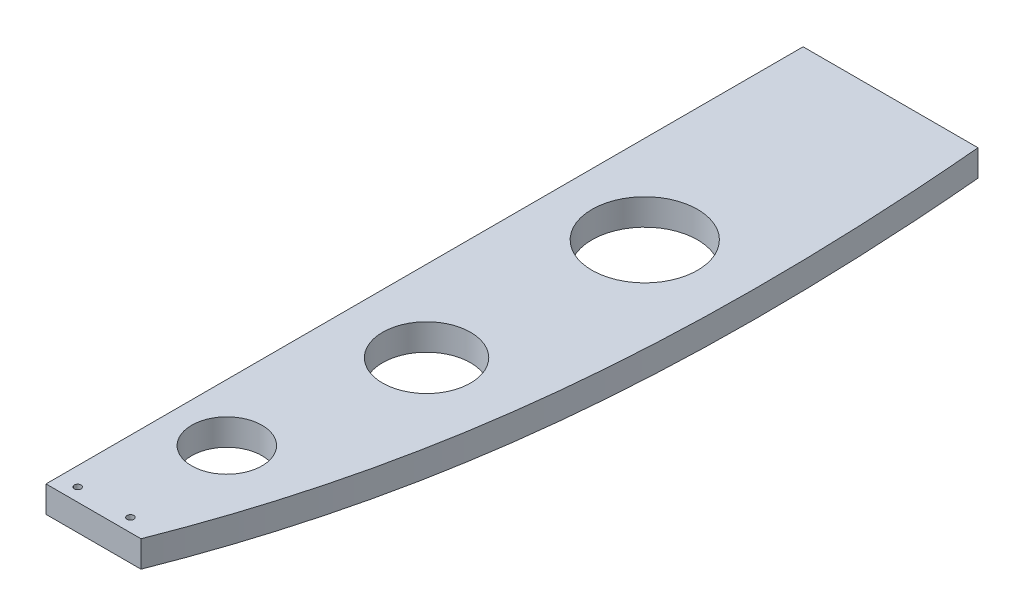
ISO-10303-21;
HEADER;
FILE_DESCRIPTION(('STEP AP214'),'2;1');
FILE_NAME('part.step','',(''),(''),'','','');
FILE_SCHEMA(('AUTOMOTIVE_DESIGN { 1 0 10303 214 1 1 1 1 }'));
ENDSEC;
DATA;
#1=APPLICATION_CONTEXT('core data for automotive mechanical design processes');
#2=APPLICATION_PROTOCOL_DEFINITION('international standard','automotive_design',2000,#1);
#3=PRODUCT_CONTEXT('',#1,'mechanical');
#4=PRODUCT('Part','Part','',(#3));
#5=PRODUCT_RELATED_PRODUCT_CATEGORY('part','',(#4));
#6=PRODUCT_DEFINITION_FORMATION('','',#4);
#7=PRODUCT_DEFINITION_CONTEXT('part definition',#1,'design');
#8=PRODUCT_DEFINITION('design','',#6,#7);
#9=PRODUCT_DEFINITION_SHAPE('','',#8);
#10=(LENGTH_UNIT() NAMED_UNIT(*) SI_UNIT(.MILLI.,.METRE.));
#11=(NAMED_UNIT(*) PLANE_ANGLE_UNIT() SI_UNIT($,.RADIAN.));
#12=(NAMED_UNIT(*) SI_UNIT($,.STERADIAN.) SOLID_ANGLE_UNIT());
#13=UNCERTAINTY_MEASURE_WITH_UNIT(LENGTH_MEASURE(1.E-05),#10,'distance_accuracy_value','');
#14=(GEOMETRIC_REPRESENTATION_CONTEXT(3) GLOBAL_UNCERTAINTY_ASSIGNED_CONTEXT((#13)) GLOBAL_UNIT_ASSIGNED_CONTEXT((#10,
#11,#12)) REPRESENTATION_CONTEXT('',''));
#15=CARTESIAN_POINT('',(0.,0.,0.));
#16=DIRECTION('',(0.,0.,1.));
#17=DIRECTION('',(1.,0.,0.));
#18=AXIS2_PLACEMENT_3D('',#15,#16,#17);
#19=CARTESIAN_POINT('',(392.7204761884,5372.10000000001,2956.72721358892));
#20=DIRECTION('',(0.,1.,0.));
#21=DIRECTION('',(0.,0.,1.));
#22=AXIS2_PLACEMENT_3D('',#19,#20,#21);
#23=PLANE('',#22);
#24=CARTESIAN_POINT('',(376.528681754696,5372.10000000001,3220.41942707642));
#25=DIRECTION('',(0.,1.,0.));
#26=DIRECTION('',(0.,0.,1.));
#27=AXIS2_PLACEMENT_3D('',#24,#25,#26);
#28=CIRCLE('',#27,2.45744999999997);
#29=CARTESIAN_POINT('',(376.528681754696,5372.10000000001,3222.87687707642));
#30=VERTEX_POINT('',#29);
#31=EDGE_CURVE('E494',#30,#30,#28,.T.);
#32=ORIENTED_EDGE('',*,*,#31,.T.);
#33=EDGE_LOOP('',(#32));
#34=FACE_BOUND('',#33,.T.);
#35=CARTESIAN_POINT('',(338.428578956858,5372.1,3220.41942707651));
#36=DIRECTION('',(0.,1.,0.));
#37=DIRECTION('',(0.,0.,1.));
#38=AXIS2_PLACEMENT_3D('',#35,#36,#37);
#39=CIRCLE('',#38,2.45744999999997);
#40=CARTESIAN_POINT('',(338.428578956858,5372.1,3222.87687707651));
#41=VERTEX_POINT('',#40);
#42=EDGE_CURVE('E129',#41,#41,#39,.T.);
#43=ORIENTED_EDGE('',*,*,#42,.T.);
#44=EDGE_LOOP('',(#43));
#45=FACE_BOUND('',#44,.T.);
#46=CARTESIAN_POINT('',(388.619999999992,5372.10000000001,2861.31));
#47=DIRECTION('',(0.,1.,0.));
#48=DIRECTION('',(-1.,0.,0.));
#49=AXIS2_PLACEMENT_3D('',#46,#47,#48);
#50=CIRCLE('',#49,38.0999999999997);
#51=CARTESIAN_POINT('',(350.519999999992,5372.10000000001,2861.31));
#52=VERTEX_POINT('',#51);
#53=EDGE_CURVE('E171',#52,#52,#50,.T.);
#54=ORIENTED_EDGE('',*,*,#53,.T.);
#55=EDGE_LOOP('',(#54));
#56=FACE_BOUND('',#55,.T.);
#57=CARTESIAN_POINT('',(383.539999999996,5372.10000000001,3013.71));
#58=DIRECTION('',(0.,1.,0.));
#59=DIRECTION('',(-1.,0.,0.));
#60=AXIS2_PLACEMENT_3D('',#57,#58,#59);
#61=CIRCLE('',#60,31.75);
#62=CARTESIAN_POINT('',(351.789999999996,5372.10000000001,3013.71));
#63=VERTEX_POINT('',#62);
#64=EDGE_CURVE('E519',#63,#63,#61,.T.);
#65=ORIENTED_EDGE('',*,*,#64,.T.);
#66=EDGE_LOOP('',(#65));
#67=FACE_BOUND('',#66,.T.);
#68=CARTESIAN_POINT('',(366.394999999993,5372.10000000001,3140.71));
#69=DIRECTION('',(0.,1.,0.));
#70=DIRECTION('',(-1.,0.,0.));
#71=AXIS2_PLACEMENT_3D('',#68,#69,#70);
#72=CIRCLE('',#71,25.4);
#73=CARTESIAN_POINT('',(340.994999999993,5372.1,3140.71));
#74=VERTEX_POINT('',#73);
#75=EDGE_CURVE('E185',#74,#74,#72,.T.);
#76=ORIENTED_EDGE('',*,*,#75,.T.);
#77=EDGE_LOOP('',(#76));
#78=FACE_BOUND('',#77,.T.);
#79=DIRECTION('',(0.,0.,1.));
#80=VECTOR('',#79,1.);
#81=CARTESIAN_POINT('',(325.120000000001,5372.1,2683.51));
#82=LINE('',#81,#80);
#83=CARTESIAN_POINT('',(325.120000000001,5372.1,2683.51));
#84=VERTEX_POINT('',#83);
#85=CARTESIAN_POINT('',(325.120000000001,5372.1,3229.94442717783));
#86=VERTEX_POINT('',#85);
#87=EDGE_CURVE('E177',#84,#86,#82,.T.);
#88=ORIENTED_EDGE('',*,*,#87,.F.);
#89=DIRECTION('',(-1.,0.,0.));
#90=VECTOR('',#89,1.);
#91=CARTESIAN_POINT('',(451.328190233737,5372.1,2683.51));
#92=LINE('',#91,#90);
#93=CARTESIAN_POINT('',(451.328190233737,5372.1,2683.51));
#94=VERTEX_POINT('',#93);
#95=EDGE_CURVE('E178',#94,#84,#92,.T.);
#96=ORIENTED_EDGE('',*,*,#95,.F.);
#97=CARTESIAN_POINT('',(393.682548612298,5372.1,3229.94442717783));
#98=CARTESIAN_POINT('',(394.456887278262,5372.10000000001,3227.97409267507));
#99=CARTESIAN_POINT('',(395.22441838666,5372.10000000001,3226.00108202925));
#100=CARTESIAN_POINT('',(396.745699742088,5372.10000000001,3222.04984801669));
#101=CARTESIAN_POINT('',(397.499450552645,5372.10000000001,3220.07162486692));
#102=CARTESIAN_POINT('',(398.993053269484,5372.10000000001,3216.10998577864));
#103=CARTESIAN_POINT('',(399.732905469337,5372.10000000001,3214.12656995082));
#104=CARTESIAN_POINT('',(401.198834415248,5372.10000000001,3210.1539474909));
#105=CARTESIAN_POINT('',(401.924906766052,5372.10000000001,3208.16473923706));
#106=CARTESIAN_POINT('',(403.362939318138,5372.10000000001,3204.18117724008));
#107=CARTESIAN_POINT('',(404.074899215258,5372.10000000001,3202.18682338709));
#108=CARTESIAN_POINT('',(405.484616665228,5372.10000000001,3198.19301213818));
#109=CARTESIAN_POINT('',(406.182373587812,5372.1,3196.1935545202));
#110=CARTESIAN_POINT('',(408.953173030685,5372.1,3188.16137490409));
#111=CARTESIAN_POINT('',(410.968400672619,5372.10000000001,3182.10857083572));
#112=CARTESIAN_POINT('',(414.867042059988,5372.10000000001,3169.9598314745));
#113=CARTESIAN_POINT('',(416.750437957194,5372.10000000001,3163.86389046404));
#114=CARTESIAN_POINT('',(420.384172507284,5372.10000000001,3151.63202096789));
#115=CARTESIAN_POINT('',(422.134502345281,5372.10000000001,3145.49608986225));
#116=CARTESIAN_POINT('',(425.501734798348,5372.10000000001,3133.18776982584));
#117=CARTESIAN_POINT('',(427.118638031934,5372.10000000001,3127.01538106421));
#118=CARTESIAN_POINT('',(430.220289757622,5372.10000000001,3114.6349025104));
#119=CARTESIAN_POINT('',(431.704985678234,5372.10000000001,3108.42679955209));
#120=CARTESIAN_POINT('',(434.542919092934,5372.10000000001,3095.98083496866));
#121=CARTESIAN_POINT('',(435.896160515654,5372.10000000001,3089.74297423873));
#122=CARTESIAN_POINT('',(438.47341999692,5372.10000000001,3077.24069251174));
#123=CARTESIAN_POINT('',(439.697439319749,5372.10000000001,3070.97627177516));
#124=CARTESIAN_POINT('',(442.019093536707,5372.10000000001,3058.4242371645));
#125=CARTESIAN_POINT('',(443.116730957582,5372.10000000001,3052.1366237567));
#126=CARTESIAN_POINT('',(445.531902422021,5372.10000000001,3037.45725662658));
#127=CARTESIAN_POINT('',(446.802022602101,5372.10000000001,3029.05767164538));
#128=CARTESIAN_POINT('',(449.133660073009,5372.10000000001,3012.22966620934));
#129=CARTESIAN_POINT('',(450.195175381904,5372.10000000001,3003.80124548132));
#130=CARTESIAN_POINT('',(452.11986547059,5372.10000000001,2986.92177852863));
#131=CARTESIAN_POINT('',(452.983038440593,5372.10000000001,2978.47073209822));
#132=CARTESIAN_POINT('',(454.521823137451,5372.10000000001,2961.55244648694));
#133=CARTESIAN_POINT('',(455.197451604686,5372.10000000001,2953.08520881929));
#134=CARTESIAN_POINT('',(456.372394967283,5372.10000000001,2936.13867906095));
#135=CARTESIAN_POINT('',(456.871712957139,5372.10000000001,2927.65938718446));
#136=CARTESIAN_POINT('',(457.49682462189,5372.10000000001,2914.93467998271));
#137=CARTESIAN_POINT('',(457.68454951338,5372.10000000001,2910.69219806394));
#138=CARTESIAN_POINT('',(458.020084952675,5372.10000000001,2902.20564766661));
#139=CARTESIAN_POINT('',(458.167895578348,5372.1,2897.96157919117));
#140=CARTESIAN_POINT('',(458.392613866849,5372.1,2890.54167375211));
#141=CARTESIAN_POINT('',(458.478002740263,5372.10000000001,2887.36608909858));
#142=CARTESIAN_POINT('',(458.62741559634,5372.10000000001,2881.01442207913));
#143=CARTESIAN_POINT('',(458.69143962297,5372.10000000001,2877.83833971425));
#144=CARTESIAN_POINT('',(458.798866254698,5372.10000000001,2871.48592736605));
#145=CARTESIAN_POINT('',(458.84226950691,5372.10000000001,2868.30959739364));
#146=CARTESIAN_POINT('',(458.909067808655,5372.10000000001,2861.95672988344));
#147=CARTESIAN_POINT('',(458.932462844902,5372.10000000001,2858.78019234552));
#148=CARTESIAN_POINT('',(458.973523832037,5372.10000000001,2849.25164706475));
#149=CARTESIAN_POINT('',(458.96208571327,5372.10000000001,2842.8994936941));
#150=CARTESIAN_POINT('',(458.865746069072,5372.10000000001,2830.19568475043));
#151=CARTESIAN_POINT('',(458.780843498029,5372.1,2823.8440291858));
#152=CARTESIAN_POINT('',(458.555440423178,5372.1,2811.90254793619));
#153=CARTESIAN_POINT('',(458.422814807489,5372.10000000001,2806.31257153563));
#154=CARTESIAN_POINT('',(458.10539774139,5372.10000000001,2795.13403521731));
#155=CARTESIAN_POINT('',(457.920605650512,5372.10000000001,2789.54547531779));
#156=CARTESIAN_POINT('',(457.50058654664,5372.10000000001,2778.37016686811));
#157=CARTESIAN_POINT('',(457.265358727712,5372.10000000001,2772.78341834832));
#158=CARTESIAN_POINT('',(456.745902375998,5372.10000000001,2761.61213595354));
#159=CARTESIAN_POINT('',(456.461673251714,5372.10000000001,2756.02760210611));
#160=CARTESIAN_POINT('',(455.845303056687,5372.10000000001,2744.86008184125));
#161=CARTESIAN_POINT('',(455.513152591963,5372.10000000001,2739.27709594277));
#162=CARTESIAN_POINT('',(454.801842865256,5372.10000000001,2728.11418570015));
#163=CARTESIAN_POINT('',(454.422684125744,5372.10000000001,2722.53426132267));
#164=CARTESIAN_POINT('',(453.617925963619,5372.10000000001,2711.3779283249));
#165=CARTESIAN_POINT('',(453.192327964685,5372.10000000001,2705.80151960209));
#166=CARTESIAN_POINT('',(452.519277338355,5372.10000000001,2697.4398551389));
#167=CARTESIAN_POINT('',(452.289157668395,5372.10000000001,2694.65319423764));
#168=CARTESIAN_POINT('',(451.817351920112,5372.10000000001,2689.08085188907));
#169=CARTESIAN_POINT('',(451.575665842302,5372.10000000001,2686.29517044172));
#170=CARTESIAN_POINT('',(451.328190233737,5372.1,2683.51));
#171=B_SPLINE_CURVE_WITH_KNOTS('',3,(#97,#98,#99,#100,#101,#102,#103,#104,#105,#106,#107,#108,
#109,#110,#111,#112,#113,#114,#115,#116,#117,#118,#119,#120,#121,#122,#123,#124,#125,#126,#127,
#128,#129,#130,#131,#132,#133,#134,#135,#136,#137,#138,#139,#140,#141,#142,#143,#144,#145,#146,
#147,#148,#149,#150,#151,#152,#153,#154,#155,#156,#157,#158,#159,#160,#161,#162,#163,#164,#165,
#166,#167,#168,#169,#170),.UNSPECIFIED.,.F.,.F.,(4,2,2,2,2,2,2,2,2,2,2,2,2,2,2,2,2,2,2,2,2,2,2,
2,2,2,2,2,2,2,2,2,2,2,2,2,4),(0.,6.3510800999697,12.7018998972623,19.0525853991748,
25.4052635958797,31.758078562147,38.1111748266895,57.2478936892714,76.3871984126704,
95.5277699060846,114.668252666238,133.81631285668,152.963800614739,172.111101020309,
191.258018548429,216.740350751248,242.222925047356,267.705731851512,293.186263306882,
318.666347521116,331.406097269968,344.14582216444,353.675953643451,363.206065510392,
372.735878286333,382.265697390111,401.321696469499,420.37796677574,437.152367296032,
453.926973771487,470.701848315526,487.476925363985,504.255295296113,521.033478762761,
537.811148008955,546.199566113041,554.587983845861),.UNSPECIFIED.);
#172=CARTESIAN_POINT('',(393.682548612297,5372.10000000001,3229.94442717783));
#173=VERTEX_POINT('',#172);
#174=EDGE_CURVE('E96',#173,#94,#171,.T.);
#175=ORIENTED_EDGE('',*,*,#174,.F.);
#176=DIRECTION('',(1.,0.,0.));
#177=VECTOR('',#176,1.);
#178=CARTESIAN_POINT('',(325.120000000001,5372.1,3229.94442717783));
#179=LINE('',#178,#177);
#180=EDGE_CURVE('E203',#86,#173,#179,.T.);
#181=ORIENTED_EDGE('',*,*,#180,.F.);
#182=EDGE_LOOP('',(#88,#96,#175,#181));
#183=FACE_BOUND('',#182,.T.);
#184=ADVANCED_FACE('F50',(#34,#45,#56,#67,#78,#183),#23,.F.);
#185=CARTESIAN_POINT('',(325.120000000001,5372.1,3229.94442717783));
#186=DIRECTION('',(0.,0.,1.));
#187=DIRECTION('',(1.,0.,0.));
#188=AXIS2_PLACEMENT_3D('',#185,#186,#187);
#189=PLANE('',#188);
#190=DIRECTION('',(1.,0.,0.));
#191=VECTOR('',#190,1.);
#192=CARTESIAN_POINT('',(392.720476188399,5391.15000000001,3229.94442717783));
#193=LINE('',#192,#191);
#194=CARTESIAN_POINT('',(325.12,5391.15000000001,3229.94442717783));
#195=VERTEX_POINT('',#194);
#196=CARTESIAN_POINT('',(393.682548612297,5391.15000000001,3229.94442717783));
#197=VERTEX_POINT('',#196);
#198=EDGE_CURVE('E168',#195,#197,#193,.T.);
#199=ORIENTED_EDGE('',*,*,#198,.F.);
#200=DIRECTION('',(0.,1.,0.));
#201=VECTOR('',#200,1.);
#202=CARTESIAN_POINT('',(325.120000000001,5372.1,3229.94442717783));
#203=LINE('',#202,#201);
#204=EDGE_CURVE('E186',#86,#195,#203,.T.);
#205=ORIENTED_EDGE('',*,*,#204,.F.);
#206=ORIENTED_EDGE('',*,*,#180,.T.);
#207=DIRECTION('',(0.,-1.,0.));
#208=VECTOR('',#207,1.);
#209=CARTESIAN_POINT('',(393.682548612297,5381.62500000001,3229.94442717783));
#210=LINE('',#209,#208);
#211=EDGE_CURVE('E189',#197,#173,#210,.T.);
#212=ORIENTED_EDGE('',*,*,#211,.F.);
#213=EDGE_LOOP('',(#199,#205,#206,#212));
#214=FACE_BOUND('',#213,.T.);
#215=ADVANCED_FACE('F247',(#214),#189,.T.);
#216=CARTESIAN_POINT('',(393.682548612298,5372.1,3229.94442717783));
#217=CARTESIAN_POINT('',(393.682548612297,5391.15000000001,3229.94442717783));
#218=CARTESIAN_POINT('',(433.140972393041,5372.10000000001,3129.54068836821));
#219=CARTESIAN_POINT('',(433.140972393041,5391.15000000001,3129.54068836821));
#220=CARTESIAN_POINT('',(454.834742459106,5372.10000000001,3022.43692802554));
#221=CARTESIAN_POINT('',(454.834742459107,5391.15000000001,3022.43692802554));
#222=CARTESIAN_POINT('',(460.31282851818,5372.1,2819.19788970161));
#223=CARTESIAN_POINT('',(460.312828518182,5391.15,2819.19788970161));
#224=CARTESIAN_POINT('',(457.003208667206,5372.10000000001,2747.37762040659));
#225=CARTESIAN_POINT('',(457.003208667206,5391.15000000001,2747.37762040659));
#226=CARTESIAN_POINT('',(451.328190233737,5372.1,2683.51));
#227=CARTESIAN_POINT('',(451.328190233737,5391.15,2683.51));
#228=B_SPLINE_SURFACE_WITH_KNOTS('',3,1,((#216,#217),(#218,#219),(#220,#221),(#222,#223),(#224,
#225),(#226,#227)),.UNSPECIFIED.,.F.,.F.,.F.,(4,2,4),(2,2),(-54.2493510406912,-24.5787816023228,
-9.05068072297407),(0.,1.90499999999997),.UNSPECIFIED.);
#229=CARTESIAN_POINT('',(393.682548612297,5391.15000000001,3229.94442717783));
#230=CARTESIAN_POINT('',(394.456887278261,5391.15000000001,3227.97409267507));
#231=CARTESIAN_POINT('',(395.22441838666,5391.15000000001,3226.00108202925));
#232=CARTESIAN_POINT('',(396.745699742087,5391.15000000001,3222.04984801669));
#233=CARTESIAN_POINT('',(397.499450552644,5391.15000000001,3220.07162486693));
#234=CARTESIAN_POINT('',(398.993053269484,5391.15000000001,3216.10998577864));
#235=CARTESIAN_POINT('',(399.732905469337,5391.15000000001,3214.12656995082));
#236=CARTESIAN_POINT('',(401.198834415248,5391.15000000001,3210.1539474909));
#237=CARTESIAN_POINT('',(401.924906766051,5391.15000000001,3208.16473923706));
#238=CARTESIAN_POINT('',(403.362939318138,5391.15000000001,3204.18117724008));
#239=CARTESIAN_POINT('',(404.074899215258,5391.15000000001,3202.18682338709));
#240=CARTESIAN_POINT('',(405.484616665228,5391.15000000001,3198.19301213818));
#241=CARTESIAN_POINT('',(406.182373587812,5391.15000000001,3196.1935545202));
#242=CARTESIAN_POINT('',(408.953173030685,5391.15,3188.16137490409));
#243=CARTESIAN_POINT('',(410.968400672619,5391.15000000001,3182.10857083572));
#244=CARTESIAN_POINT('',(414.867042059988,5391.15000000001,3169.9598314745));
#245=CARTESIAN_POINT('',(416.750437957194,5391.15000000001,3163.86389046404));
#246=CARTESIAN_POINT('',(420.384172507285,5391.15000000001,3151.63202096789));
#247=CARTESIAN_POINT('',(422.134502345281,5391.15000000001,3145.49608986225));
#248=CARTESIAN_POINT('',(425.501734798349,5391.15000000001,3133.18776982584));
#249=CARTESIAN_POINT('',(427.118638031935,5391.15000000001,3127.01538106421));
#250=CARTESIAN_POINT('',(430.220289757623,5391.15000000001,3114.6349025104));
#251=CARTESIAN_POINT('',(431.704985678234,5391.15000000001,3108.42679955209));
#252=CARTESIAN_POINT('',(434.542919092935,5391.15000000001,3095.98083496866));
#253=CARTESIAN_POINT('',(435.896160515654,5391.15000000001,3089.74297423873));
#254=CARTESIAN_POINT('',(438.47341999692,5391.15000000001,3077.24069251174));
#255=CARTESIAN_POINT('',(439.697439319749,5391.15000000001,3070.97627177516));
#256=CARTESIAN_POINT('',(442.019093536707,5391.15000000001,3058.4242371645));
#257=CARTESIAN_POINT('',(443.116730957582,5391.15000000001,3052.1366237567));
#258=CARTESIAN_POINT('',(445.531902422022,5391.15000000001,3037.45725662658));
#259=CARTESIAN_POINT('',(446.802022602101,5391.15000000001,3029.05767164538));
#260=CARTESIAN_POINT('',(449.133660073009,5391.15000000001,3012.22966620934));
#261=CARTESIAN_POINT('',(450.195175381905,5391.15000000001,3003.80124548132));
#262=CARTESIAN_POINT('',(452.11986547059,5391.15000000001,2986.92177852863));
#263=CARTESIAN_POINT('',(452.983038440593,5391.15000000001,2978.47073209822));
#264=CARTESIAN_POINT('',(454.521823137452,5391.15000000001,2961.55244648694));
#265=CARTESIAN_POINT('',(455.197451604687,5391.15000000001,2953.08520881929));
#266=CARTESIAN_POINT('',(456.372394967283,5391.15000000001,2936.13867906095));
#267=CARTESIAN_POINT('',(456.87171295714,5391.15000000001,2927.65938718446));
#268=CARTESIAN_POINT('',(457.496824621891,5391.15000000001,2914.93467998271));
#269=CARTESIAN_POINT('',(457.684549513381,5391.15000000001,2910.69219806394));
#270=CARTESIAN_POINT('',(458.020084952676,5391.15000000001,2902.20564766661));
#271=CARTESIAN_POINT('',(458.167895578349,5391.15000000001,2897.96157919117));
#272=CARTESIAN_POINT('',(458.39261386685,5391.15000000001,2890.54167375211));
#273=CARTESIAN_POINT('',(458.478002740264,5391.15000000001,2887.36608909858));
#274=CARTESIAN_POINT('',(458.627415596341,5391.15000000001,2881.01442207913));
#275=CARTESIAN_POINT('',(458.691439622971,5391.15000000001,2877.83833971425));
#276=CARTESIAN_POINT('',(458.798866254699,5391.15000000001,2871.48592736605));
#277=CARTESIAN_POINT('',(458.842269506912,5391.15000000001,2868.30959739364));
#278=CARTESIAN_POINT('',(458.909067808656,5391.15000000001,2861.95672988344));
#279=CARTESIAN_POINT('',(458.932462844903,5391.15000000001,2858.78019234552));
#280=CARTESIAN_POINT('',(458.973523832038,5391.15000000001,2849.25164706475));
#281=CARTESIAN_POINT('',(458.962085713271,5391.15000000001,2842.8994936941));
#282=CARTESIAN_POINT('',(458.865746069074,5391.15000000001,2830.19568475043));
#283=CARTESIAN_POINT('',(458.78084349803,5391.15000000001,2823.8440291858));
#284=CARTESIAN_POINT('',(458.555440423179,5391.15000000001,2811.90254793619));
#285=CARTESIAN_POINT('',(458.42281480749,5391.15000000001,2806.31257153562));
#286=CARTESIAN_POINT('',(458.105397741391,5391.15000000001,2795.13403521731));
#287=CARTESIAN_POINT('',(457.920605650513,5391.15000000001,2789.54547531779));
#288=CARTESIAN_POINT('',(457.500586546641,5391.15000000001,2778.37016686811));
#289=CARTESIAN_POINT('',(457.265358727713,5391.15000000001,2772.78341834832));
#290=CARTESIAN_POINT('',(456.745902375998,5391.15000000001,2761.61213595354));
#291=CARTESIAN_POINT('',(456.461673251714,5391.15000000001,2756.0276021061));
#292=CARTESIAN_POINT('',(455.845303056687,5391.15000000001,2744.86008184125));
#293=CARTESIAN_POINT('',(455.513152591963,5391.15000000001,2739.27709594277));
#294=CARTESIAN_POINT('',(454.801842865256,5391.15000000001,2728.11418570015));
#295=CARTESIAN_POINT('',(454.422684125743,5391.15000000001,2722.53426132267));
#296=CARTESIAN_POINT('',(453.617925963619,5391.15000000001,2711.3779283249));
#297=CARTESIAN_POINT('',(453.192327964684,5391.15000000001,2705.80151960208));
#298=CARTESIAN_POINT('',(452.519277338355,5391.15000000001,2697.4398551389));
#299=CARTESIAN_POINT('',(452.289157668394,5391.15000000001,2694.65319423764));
#300=CARTESIAN_POINT('',(451.817351920112,5391.15000000001,2689.08085188907));
#301=CARTESIAN_POINT('',(451.575665842301,5391.15000000001,2686.29517044172));
#302=CARTESIAN_POINT('',(451.328190233737,5391.15,2683.51));
#303=B_SPLINE_CURVE_WITH_KNOTS('',3,(#229,#230,#231,#232,#233,#234,#235,#236,#237,#238,#239,
#240,#241,#242,#243,#244,#245,#246,#247,#248,#249,#250,#251,#252,#253,#254,#255,#256,#257,#258,
#259,#260,#261,#262,#263,#264,#265,#266,#267,#268,#269,#270,#271,#272,#273,#274,#275,#276,#277,
#278,#279,#280,#281,#282,#283,#284,#285,#286,#287,#288,#289,#290,#291,#292,#293,#294,#295,#296,
#297,#298,#299,#300,#301,#302),.UNSPECIFIED.,.F.,.F.,(4,2,2,2,2,2,2,2,2,2,2,2,2,2,2,2,2,2,2,2,2,
2,2,2,2,2,2,2,2,2,2,2,2,2,2,2,4),(0.,6.35108009997003,12.7018998972629,19.0525853991757,
25.405263595881,31.758078562148,38.1111748266914,57.2478936892729,76.3871984126719,
95.5277699060862,114.66825266624,133.816312856681,152.963800614739,172.11110102031,
191.258018548429,216.740350751249,242.222925047357,267.705731851512,293.186263306884,
318.666347521117,331.40609726997,344.145822164442,353.675953643452,363.206065510394,
372.735878286334,382.265697390112,401.321696469501,420.377966775742,437.152367296034,
453.926973771489,470.701848315529,487.476925363988,504.255295296116,521.033478762764,
537.811148008959,546.199566113044,554.587983845864),.UNSPECIFIED.);
#304=CARTESIAN_POINT('',(451.328190233737,5391.15,2683.51));
#305=VERTEX_POINT('',#304);
#306=EDGE_CURVE('E165',#197,#305,#303,.T.);
#307=DIRECTION('',(0.,1.,0.));
#308=VECTOR('',#307,1.);
#309=CARTESIAN_POINT('',(451.328190233737,5372.1,2683.51));
#310=LINE('',#309,#308);
#311=EDGE_CURVE('E174',#305,#94,#310,.F.);
#312=ORIENTED_EDGE('',*,*,#306,.F.);
#313=ORIENTED_EDGE('',*,*,#211,.T.);
#314=ORIENTED_EDGE('',*,*,#174,.T.);
#315=ORIENTED_EDGE('',*,*,#311,.F.);
#316=EDGE_LOOP('',(#312,#313,#314,#315));
#317=FACE_BOUND('',#316,.T.);
#318=ADVANCED_FACE('F52',(#317),#228,.T.);
#319=CARTESIAN_POINT('',(451.328190233737,5372.1,2683.51));
#320=DIRECTION('',(0.,0.,-1.));
#321=DIRECTION('',(-1.,0.,0.));
#322=AXIS2_PLACEMENT_3D('',#319,#320,#321);
#323=PLANE('',#322);
#324=CARTESIAN_POINT('',(419.531342480866,5381.625,2683.51));
#325=DIRECTION('',(0.,0.,-1.));
#326=DIRECTION('',(-1.,0.,0.));
#327=AXIS2_PLACEMENT_3D('',#324,#325,#326);
#328=CIRCLE('',#327,0.991870000000006);
#329=CARTESIAN_POINT('',(418.539472480866,5381.625,2683.51));
#330=VERTEX_POINT('',#329);
#331=EDGE_CURVE('E156',#330,#330,#328,.T.);
#332=ORIENTED_EDGE('',*,*,#331,.F.);
#333=EDGE_LOOP('',(#332));
#334=FACE_BOUND('',#333,.T.);
#335=CARTESIAN_POINT('',(356.590447493623,5381.625,2683.51));
#336=DIRECTION('',(0.,0.,-1.));
#337=DIRECTION('',(-1.,0.,0.));
#338=AXIS2_PLACEMENT_3D('',#335,#336,#337);
#339=CIRCLE('',#338,0.991870000000006);
#340=CARTESIAN_POINT('',(355.598577493623,5381.625,2683.51));
#341=VERTEX_POINT('',#340);
#342=EDGE_CURVE('E160',#341,#341,#339,.T.);
#343=ORIENTED_EDGE('',*,*,#342,.F.);
#344=EDGE_LOOP('',(#343));
#345=FACE_BOUND('',#344,.T.);
#346=DIRECTION('',(1.,0.,0.));
#347=VECTOR('',#346,1.);
#348=CARTESIAN_POINT('',(392.7204761884,5391.15000000001,2683.51));
#349=LINE('',#348,#347);
#350=CARTESIAN_POINT('',(325.12,5391.15,2683.51));
#351=VERTEX_POINT('',#350);
#352=EDGE_CURVE('E161',#305,#351,#349,.F.);
#353=ORIENTED_EDGE('',*,*,#352,.F.);
#354=ORIENTED_EDGE('',*,*,#311,.T.);
#355=ORIENTED_EDGE('',*,*,#95,.T.);
#356=DIRECTION('',(0.,1.,0.));
#357=VECTOR('',#356,1.);
#358=CARTESIAN_POINT('',(325.120000000001,5372.1,2683.51));
#359=LINE('',#358,#357);
#360=EDGE_CURVE('E72',#351,#84,#359,.F.);
#361=ORIENTED_EDGE('',*,*,#360,.F.);
#362=EDGE_LOOP('',(#353,#354,#355,#361));
#363=FACE_BOUND('',#362,.T.);
#364=ADVANCED_FACE('F242',(#334,#345,#363),#323,.T.);
#365=CARTESIAN_POINT('',(325.120000000001,5372.1,2683.51));
#366=DIRECTION('',(-1.,0.,0.));
#367=DIRECTION('',(0.,0.,1.));
#368=AXIS2_PLACEMENT_3D('',#365,#366,#367);
#369=PLANE('',#368);
#370=CARTESIAN_POINT('',(325.119999999999,5381.625,2785.11));
#371=DIRECTION('',(-1.,0.,0.));
#372=DIRECTION('',(0.,0.,1.));
#373=AXIS2_PLACEMENT_3D('',#370,#371,#372);
#374=CIRCLE('',#373,0.991870000000006);
#375=CARTESIAN_POINT('',(325.119999999999,5381.625,2786.10187));
#376=VERTEX_POINT('',#375);
#377=EDGE_CURVE('E57',#376,#376,#374,.T.);
#378=ORIENTED_EDGE('',*,*,#377,.F.);
#379=EDGE_LOOP('',(#378));
#380=FACE_BOUND('',#379,.T.);
#381=CARTESIAN_POINT('',(325.12,5381.625,2886.71));
#382=DIRECTION('',(-1.,0.,0.));
#383=DIRECTION('',(0.,0.,1.));
#384=AXIS2_PLACEMENT_3D('',#381,#382,#383);
#385=CIRCLE('',#384,0.991870000000006);
#386=CARTESIAN_POINT('',(325.12,5381.625,2887.70187));
#387=VERTEX_POINT('',#386);
#388=EDGE_CURVE('E140',#387,#387,#385,.T.);
#389=ORIENTED_EDGE('',*,*,#388,.F.);
#390=EDGE_LOOP('',(#389));
#391=FACE_BOUND('',#390,.T.);
#392=CARTESIAN_POINT('',(325.120000000002,5381.625,2988.31));
#393=DIRECTION('',(-1.,0.,0.));
#394=DIRECTION('',(0.,0.,1.));
#395=AXIS2_PLACEMENT_3D('',#392,#393,#394);
#396=CIRCLE('',#395,0.991870000000006);
#397=CARTESIAN_POINT('',(325.120000000002,5381.625,2989.30187));
#398=VERTEX_POINT('',#397);
#399=EDGE_CURVE('E144',#398,#398,#396,.T.);
#400=ORIENTED_EDGE('',*,*,#399,.F.);
#401=EDGE_LOOP('',(#400));
#402=FACE_BOUND('',#401,.T.);
#403=CARTESIAN_POINT('',(325.120000000002,5381.62500000001,3089.91));
#404=DIRECTION('',(-1.,0.,0.));
#405=DIRECTION('',(0.,0.,1.));
#406=AXIS2_PLACEMENT_3D('',#403,#404,#405);
#407=CIRCLE('',#406,0.991870000000006);
#408=CARTESIAN_POINT('',(325.120000000002,5381.62500000001,3090.90187));
#409=VERTEX_POINT('',#408);
#410=EDGE_CURVE('E148',#409,#409,#407,.T.);
#411=ORIENTED_EDGE('',*,*,#410,.F.);
#412=EDGE_LOOP('',(#411));
#413=FACE_BOUND('',#412,.T.);
#414=CARTESIAN_POINT('',(325.120000000001,5381.62500000001,3191.51));
#415=DIRECTION('',(-1.,0.,0.));
#416=DIRECTION('',(0.,0.,1.));
#417=AXIS2_PLACEMENT_3D('',#414,#415,#416);
#418=CIRCLE('',#417,0.991870000000006);
#419=CARTESIAN_POINT('',(325.120000000001,5381.62500000001,3192.50187));
#420=VERTEX_POINT('',#419);
#421=EDGE_CURVE('E152',#420,#420,#418,.T.);
#422=ORIENTED_EDGE('',*,*,#421,.F.);
#423=EDGE_LOOP('',(#422));
#424=FACE_BOUND('',#423,.T.);
#425=DIRECTION('',(0.,0.,1.));
#426=VECTOR('',#425,1.);
#427=CARTESIAN_POINT('',(325.120000000003,5391.15000000001,2956.72721358892));
#428=LINE('',#427,#426);
#429=EDGE_CURVE('E164',#351,#195,#428,.T.);
#430=ORIENTED_EDGE('',*,*,#429,.F.);
#431=ORIENTED_EDGE('',*,*,#360,.T.);
#432=ORIENTED_EDGE('',*,*,#87,.T.);
#433=ORIENTED_EDGE('',*,*,#204,.T.);
#434=EDGE_LOOP('',(#430,#431,#432,#433));
#435=FACE_BOUND('',#434,.T.);
#436=ADVANCED_FACE('F238',(#380,#391,#402,#413,#424,#435),#369,.T.);
#437=CARTESIAN_POINT('',(366.395000000001,5194.30000000001,3140.71));
#438=DIRECTION('',(0.,1.,0.));
#439=DIRECTION('',(-1.,0.,0.));
#440=AXIS2_PLACEMENT_3D('',#437,#438,#439);
#441=CYLINDRICAL_SURFACE('',#440,25.4);
#442=ORIENTED_EDGE('',*,*,#75,.F.);
#443=EDGE_LOOP('',(#442));
#444=FACE_BOUND('',#443,.T.);
#445=CARTESIAN_POINT('',(366.394999999993,5391.15000000001,3140.71));
#446=DIRECTION('',(0.,1.,0.));
#447=DIRECTION('',(-1.,0.,0.));
#448=AXIS2_PLACEMENT_3D('',#445,#446,#447);
#449=CIRCLE('',#448,25.4);
#450=CARTESIAN_POINT('',(340.994999999993,5391.15000000001,3140.71));
#451=VERTEX_POINT('',#450);
#452=EDGE_CURVE('E181',#451,#451,#449,.F.);
#453=ORIENTED_EDGE('',*,*,#452,.F.);
#454=EDGE_LOOP('',(#453));
#455=FACE_BOUND('',#454,.T.);
#456=ADVANCED_FACE('F234',(#444,#455),#441,.F.);
#457=CARTESIAN_POINT('',(383.54,5194.3,3013.71));
#458=DIRECTION('',(0.,1.,0.));
#459=DIRECTION('',(-1.,0.,0.));
#460=AXIS2_PLACEMENT_3D('',#457,#458,#459);
#461=CYLINDRICAL_SURFACE('',#460,31.75);
#462=ORIENTED_EDGE('',*,*,#64,.F.);
#463=EDGE_LOOP('',(#462));
#464=FACE_BOUND('',#463,.T.);
#465=CARTESIAN_POINT('',(383.539999999993,5391.15000000001,3013.71));
#466=DIRECTION('',(0.,1.,0.));
#467=DIRECTION('',(-1.,0.,0.));
#468=AXIS2_PLACEMENT_3D('',#465,#466,#467);
#469=CIRCLE('',#468,31.75);
#470=CARTESIAN_POINT('',(351.789999999993,5391.15000000001,3013.71));
#471=VERTEX_POINT('',#470);
#472=EDGE_CURVE('E63',#471,#471,#469,.F.);
#473=ORIENTED_EDGE('',*,*,#472,.F.);
#474=EDGE_LOOP('',(#473));
#475=FACE_BOUND('',#474,.T.);
#476=ADVANCED_FACE('F230',(#464,#475),#461,.F.);
#477=CARTESIAN_POINT('',(388.620000000001,5194.30000000001,2861.31));
#478=DIRECTION('',(0.,1.,0.));
#479=DIRECTION('',(-1.,0.,0.));
#480=AXIS2_PLACEMENT_3D('',#477,#478,#479);
#481=CYLINDRICAL_SURFACE('',#480,38.0999999999997);
#482=ORIENTED_EDGE('',*,*,#53,.F.);
#483=EDGE_LOOP('',(#482));
#484=FACE_BOUND('',#483,.T.);
#485=CARTESIAN_POINT('',(388.619999999991,5391.15000000001,2861.31));
#486=DIRECTION('',(0.,1.,0.));
#487=DIRECTION('',(-1.,0.,0.));
#488=AXIS2_PLACEMENT_3D('',#485,#486,#487);
#489=CIRCLE('',#488,38.0999999999997);
#490=CARTESIAN_POINT('',(350.519999999991,5391.15,2861.31));
#491=VERTEX_POINT('',#490);
#492=EDGE_CURVE('E13',#491,#491,#489,.F.);
#493=ORIENTED_EDGE('',*,*,#492,.F.);
#494=EDGE_LOOP('',(#493));
#495=FACE_BOUND('',#494,.T.);
#496=ADVANCED_FACE('F225',(#484,#495),#481,.F.);
#497=CARTESIAN_POINT('',(392.720476188401,5391.15000000001,2956.72721358892));
#498=DIRECTION('',(0.,1.,0.));
#499=DIRECTION('',(0.,0.,1.));
#500=AXIS2_PLACEMENT_3D('',#497,#498,#499);
#501=PLANE('',#500);
#502=CARTESIAN_POINT('',(376.528681754696,5391.15000000001,3220.41942707642));
#503=DIRECTION('',(0.,1.,0.));
#504=DIRECTION('',(0.,0.,1.));
#505=AXIS2_PLACEMENT_3D('',#502,#503,#504);
#506=CIRCLE('',#505,2.45744999999997);
#507=CARTESIAN_POINT('',(376.528681754696,5391.15000000001,3222.87687707642));
#508=VERTEX_POINT('',#507);
#509=EDGE_CURVE('E491',#508,#508,#506,.T.);
#510=ORIENTED_EDGE('',*,*,#509,.F.);
#511=EDGE_LOOP('',(#510));
#512=FACE_BOUND('',#511,.T.);
#513=CARTESIAN_POINT('',(338.428578956858,5391.15000000001,3220.41942707651));
#514=DIRECTION('',(0.,1.,0.));
#515=DIRECTION('',(0.,0.,1.));
#516=AXIS2_PLACEMENT_3D('',#513,#514,#515);
#517=CIRCLE('',#516,2.45744999999997);
#518=CARTESIAN_POINT('',(338.428578956858,5391.15000000001,3222.87687707651));
#519=VERTEX_POINT('',#518);
#520=EDGE_CURVE('E134',#519,#519,#517,.T.);
#521=ORIENTED_EDGE('',*,*,#520,.F.);
#522=EDGE_LOOP('',(#521));
#523=FACE_BOUND('',#522,.T.);
#524=ORIENTED_EDGE('',*,*,#492,.T.);
#525=EDGE_LOOP('',(#524));
#526=FACE_BOUND('',#525,.T.);
#527=ORIENTED_EDGE('',*,*,#472,.T.);
#528=EDGE_LOOP('',(#527));
#529=FACE_BOUND('',#528,.T.);
#530=ORIENTED_EDGE('',*,*,#452,.T.);
#531=EDGE_LOOP('',(#530));
#532=FACE_BOUND('',#531,.T.);
#533=ORIENTED_EDGE('',*,*,#352,.T.);
#534=ORIENTED_EDGE('',*,*,#429,.T.);
#535=ORIENTED_EDGE('',*,*,#198,.T.);
#536=ORIENTED_EDGE('',*,*,#306,.T.);
#537=EDGE_LOOP('',(#533,#534,#535,#536));
#538=FACE_BOUND('',#537,.T.);
#539=ADVANCED_FACE('F219',(#512,#523,#526,#529,#532,#538),#501,.T.);
#540=CARTESIAN_POINT('',(356.590447493622,5381.62500000001,2702.56));
#541=DIRECTION('',(0.,0.,-1.));
#542=DIRECTION('',(-1.,0.,0.));
#543=AXIS2_PLACEMENT_3D('',#540,#541,#542);
#544=CONICAL_SURFACE('',#543,0.991870000000006,1.02974425867677);
#545=CARTESIAN_POINT('',(356.590447493623,5381.625,2703.1559756222));
#546=VERTEX_POINT('',#545);
#547=VERTEX_LOOP('',#546);
#548=FACE_BOUND('',#547,.T.);
#549=CARTESIAN_POINT('',(356.590447493622,5381.62500000001,2702.56));
#550=DIRECTION('',(0.,0.,-1.));
#551=DIRECTION('',(-1.,0.,0.));
#552=AXIS2_PLACEMENT_3D('',#549,#550,#551);
#553=CIRCLE('',#552,0.991870000000006);
#554=CARTESIAN_POINT('',(355.598577493622,5381.62500000001,2702.56));
#555=VERTEX_POINT('',#554);
#556=EDGE_CURVE('E157',#555,#555,#553,.T.);
#557=ORIENTED_EDGE('',*,*,#556,.T.);
#558=EDGE_LOOP('',(#557));
#559=FACE_BOUND('',#558,.T.);
#560=ADVANCED_FACE('F224',(#548,#559),#544,.F.);
#561=CARTESIAN_POINT('',(356.590447493624,5381.625,2664.46));
#562=DIRECTION('',(0.,0.,-1.));
#563=DIRECTION('',(-1.,0.,0.));
#564=AXIS2_PLACEMENT_3D('',#561,#562,#563);
#565=CYLINDRICAL_SURFACE('',#564,0.991870000000006);
#566=ORIENTED_EDGE('',*,*,#342,.T.);
#567=EDGE_LOOP('',(#566));
#568=FACE_BOUND('',#567,.T.);
#569=ORIENTED_EDGE('',*,*,#556,.F.);
#570=EDGE_LOOP('',(#569));
#571=FACE_BOUND('',#570,.T.);
#572=ADVANCED_FACE('F320',(#568,#571),#565,.F.);
#573=CARTESIAN_POINT('',(419.531342480866,5381.625,2702.56));
#574=DIRECTION('',(0.,0.,-1.));
#575=DIRECTION('',(-1.,0.,0.));
#576=AXIS2_PLACEMENT_3D('',#573,#574,#575);
#577=CONICAL_SURFACE('',#576,0.991870000000006,1.02974425867677);
#578=CARTESIAN_POINT('',(419.531342480866,5381.62500000001,2703.1559756222));
#579=VERTEX_POINT('',#578);
#580=VERTEX_LOOP('',#579);
#581=FACE_BOUND('',#580,.T.);
#582=CARTESIAN_POINT('',(419.531342480866,5381.625,2702.56));
#583=DIRECTION('',(0.,0.,-1.));
#584=DIRECTION('',(-1.,0.,0.));
#585=AXIS2_PLACEMENT_3D('',#582,#583,#584);
#586=CIRCLE('',#585,0.991870000000006);
#587=CARTESIAN_POINT('',(418.539472480866,5381.625,2702.56));
#588=VERTEX_POINT('',#587);
#589=EDGE_CURVE('E153',#588,#588,#586,.T.);
#590=ORIENTED_EDGE('',*,*,#589,.T.);
#591=EDGE_LOOP('',(#590));
#592=FACE_BOUND('',#591,.T.);
#593=ADVANCED_FACE('F326',(#581,#592),#577,.F.);
#594=CARTESIAN_POINT('',(419.531342480866,5381.625,2664.46));
#595=DIRECTION('',(0.,0.,-1.));
#596=DIRECTION('',(-1.,0.,0.));
#597=AXIS2_PLACEMENT_3D('',#594,#595,#596);
#598=CYLINDRICAL_SURFACE('',#597,0.991870000000006);
#599=ORIENTED_EDGE('',*,*,#331,.T.);
#600=EDGE_LOOP('',(#599));
#601=FACE_BOUND('',#600,.T.);
#602=ORIENTED_EDGE('',*,*,#589,.F.);
#603=EDGE_LOOP('',(#602));
#604=FACE_BOUND('',#603,.T.);
#605=ADVANCED_FACE('F333',(#601,#604),#598,.F.);
#606=CARTESIAN_POINT('',(344.17,5381.625,3191.51));
#607=DIRECTION('',(-1.,0.,0.));
#608=DIRECTION('',(0.,0.,1.));
#609=AXIS2_PLACEMENT_3D('',#606,#607,#608);
#610=CONICAL_SURFACE('',#609,0.991870000000006,1.02974425867665);
#611=CARTESIAN_POINT('',(344.765975622195,5381.62500000001,3191.51));
#612=VERTEX_POINT('',#611);
#613=VERTEX_LOOP('',#612);
#614=FACE_BOUND('',#613,.T.);
#615=CARTESIAN_POINT('',(344.17,5381.625,3191.51));
#616=DIRECTION('',(-1.,0.,0.));
#617=DIRECTION('',(0.,0.,1.));
#618=AXIS2_PLACEMENT_3D('',#615,#616,#617);
#619=CIRCLE('',#618,0.991870000000006);
#620=CARTESIAN_POINT('',(344.17,5381.625,3192.50187));
#621=VERTEX_POINT('',#620);
#622=EDGE_CURVE('E149',#621,#621,#619,.T.);
#623=ORIENTED_EDGE('',*,*,#622,.T.);
#624=EDGE_LOOP('',(#623));
#625=FACE_BOUND('',#624,.T.);
#626=ADVANCED_FACE('F340',(#614,#625),#610,.F.);
#627=CARTESIAN_POINT('',(312.420000000001,5381.62500000001,3191.51));
#628=DIRECTION('',(-1.,0.,0.));
#629=DIRECTION('',(0.,0.,1.));
#630=AXIS2_PLACEMENT_3D('',#627,#628,#629);
#631=CYLINDRICAL_SURFACE('',#630,0.991870000000006);
#632=ORIENTED_EDGE('',*,*,#421,.T.);
#633=EDGE_LOOP('',(#632));
#634=FACE_BOUND('',#633,.T.);
#635=ORIENTED_EDGE('',*,*,#622,.F.);
#636=EDGE_LOOP('',(#635));
#637=FACE_BOUND('',#636,.T.);
#638=ADVANCED_FACE('F348',(#634,#637),#631,.F.);
#639=CARTESIAN_POINT('',(344.170000000001,5381.62500000001,3089.91));
#640=DIRECTION('',(-1.,0.,0.));
#641=DIRECTION('',(0.,0.,1.));
#642=AXIS2_PLACEMENT_3D('',#639,#640,#641);
#643=CONICAL_SURFACE('',#642,0.991870000000006,1.02974425867665);
#644=CARTESIAN_POINT('',(344.765975622196,5381.625,3089.91));
#645=VERTEX_POINT('',#644);
#646=VERTEX_LOOP('',#645);
#647=FACE_BOUND('',#646,.T.);
#648=CARTESIAN_POINT('',(344.170000000001,5381.62500000001,3089.91));
#649=DIRECTION('',(-1.,0.,0.));
#650=DIRECTION('',(0.,0.,1.));
#651=AXIS2_PLACEMENT_3D('',#648,#649,#650);
#652=CIRCLE('',#651,0.991870000000006);
#653=CARTESIAN_POINT('',(344.170000000001,5381.62500000001,3090.90187));
#654=VERTEX_POINT('',#653);
#655=EDGE_CURVE('E145',#654,#654,#652,.T.);
#656=ORIENTED_EDGE('',*,*,#655,.T.);
#657=EDGE_LOOP('',(#656));
#658=FACE_BOUND('',#657,.T.);
#659=ADVANCED_FACE('F356',(#647,#658),#643,.F.);
#660=CARTESIAN_POINT('',(312.420000000002,5381.62500000001,3089.91));
#661=DIRECTION('',(-1.,0.,0.));
#662=DIRECTION('',(0.,0.,1.));
#663=AXIS2_PLACEMENT_3D('',#660,#661,#662);
#664=CYLINDRICAL_SURFACE('',#663,0.991870000000006);
#665=ORIENTED_EDGE('',*,*,#410,.T.);
#666=EDGE_LOOP('',(#665));
#667=FACE_BOUND('',#666,.T.);
#668=ORIENTED_EDGE('',*,*,#655,.F.);
#669=EDGE_LOOP('',(#668));
#670=FACE_BOUND('',#669,.T.);
#671=ADVANCED_FACE('F364',(#667,#670),#664,.F.);
#672=CARTESIAN_POINT('',(344.170000000002,5381.625,2988.31));
#673=DIRECTION('',(-1.,0.,0.));
#674=DIRECTION('',(0.,0.,1.));
#675=AXIS2_PLACEMENT_3D('',#672,#673,#674);
#676=CONICAL_SURFACE('',#675,0.991870000000006,1.02974425867665);
#677=CARTESIAN_POINT('',(344.765975622196,5381.625,2988.31));
#678=VERTEX_POINT('',#677);
#679=VERTEX_LOOP('',#678);
#680=FACE_BOUND('',#679,.T.);
#681=CARTESIAN_POINT('',(344.170000000002,5381.625,2988.31));
#682=DIRECTION('',(-1.,0.,0.));
#683=DIRECTION('',(0.,0.,1.));
#684=AXIS2_PLACEMENT_3D('',#681,#682,#683);
#685=CIRCLE('',#684,0.991870000000006);
#686=CARTESIAN_POINT('',(344.170000000002,5381.625,2989.30187));
#687=VERTEX_POINT('',#686);
#688=EDGE_CURVE('E141',#687,#687,#685,.T.);
#689=ORIENTED_EDGE('',*,*,#688,.T.);
#690=EDGE_LOOP('',(#689));
#691=FACE_BOUND('',#690,.T.);
#692=ADVANCED_FACE('F372',(#680,#691),#676,.F.);
#693=CARTESIAN_POINT('',(312.420000000002,5381.62500000001,2988.31));
#694=DIRECTION('',(-1.,0.,0.));
#695=DIRECTION('',(0.,0.,1.));
#696=AXIS2_PLACEMENT_3D('',#693,#694,#695);
#697=CYLINDRICAL_SURFACE('',#696,0.991870000000006);
#698=ORIENTED_EDGE('',*,*,#399,.T.);
#699=EDGE_LOOP('',(#698));
#700=FACE_BOUND('',#699,.T.);
#701=ORIENTED_EDGE('',*,*,#688,.F.);
#702=EDGE_LOOP('',(#701));
#703=FACE_BOUND('',#702,.T.);
#704=ADVANCED_FACE('F380',(#700,#703),#697,.F.);
#705=CARTESIAN_POINT('',(344.169999999999,5381.625,2886.71));
#706=DIRECTION('',(-1.,0.,0.));
#707=DIRECTION('',(0.,0.,1.));
#708=AXIS2_PLACEMENT_3D('',#705,#706,#707);
#709=CONICAL_SURFACE('',#708,0.991870000000006,1.02974425867665);
#710=CARTESIAN_POINT('',(344.765975622195,5381.625,2886.71));
#711=VERTEX_POINT('',#710);
#712=VERTEX_LOOP('',#711);
#713=FACE_BOUND('',#712,.T.);
#714=CARTESIAN_POINT('',(344.169999999999,5381.625,2886.71));
#715=DIRECTION('',(-1.,0.,0.));
#716=DIRECTION('',(0.,0.,1.));
#717=AXIS2_PLACEMENT_3D('',#714,#715,#716);
#718=CIRCLE('',#717,0.991870000000006);
#719=CARTESIAN_POINT('',(344.169999999999,5381.625,2887.70187));
#720=VERTEX_POINT('',#719);
#721=EDGE_CURVE('E132',#720,#720,#718,.T.);
#722=ORIENTED_EDGE('',*,*,#721,.T.);
#723=EDGE_LOOP('',(#722));
#724=FACE_BOUND('',#723,.T.);
#725=ADVANCED_FACE('F388',(#713,#724),#709,.F.);
#726=CARTESIAN_POINT('',(312.42,5381.625,2886.71));
#727=DIRECTION('',(-1.,0.,0.));
#728=DIRECTION('',(0.,0.,1.));
#729=AXIS2_PLACEMENT_3D('',#726,#727,#728);
#730=CYLINDRICAL_SURFACE('',#729,0.991870000000006);
#731=ORIENTED_EDGE('',*,*,#388,.T.);
#732=EDGE_LOOP('',(#731));
#733=FACE_BOUND('',#732,.T.);
#734=ORIENTED_EDGE('',*,*,#721,.F.);
#735=EDGE_LOOP('',(#734));
#736=FACE_BOUND('',#735,.T.);
#737=ADVANCED_FACE('F123',(#733,#736),#730,.F.);
#738=CARTESIAN_POINT('',(344.17,5381.625,2785.11));
#739=DIRECTION('',(-1.,0.,0.));
#740=DIRECTION('',(0.,0.,1.));
#741=AXIS2_PLACEMENT_3D('',#738,#739,#740);
#742=CONICAL_SURFACE('',#741,0.991870000000006,1.02974425867665);
#743=CARTESIAN_POINT('',(344.765975622195,5381.625,2785.11));
#744=VERTEX_POINT('',#743);
#745=VERTEX_LOOP('',#744);
#746=FACE_BOUND('',#745,.T.);
#747=CARTESIAN_POINT('',(344.17,5381.625,2785.11));
#748=DIRECTION('',(-1.,0.,0.));
#749=DIRECTION('',(0.,0.,1.));
#750=AXIS2_PLACEMENT_3D('',#747,#748,#749);
#751=CIRCLE('',#750,0.991870000000006);
#752=CARTESIAN_POINT('',(344.17,5381.625,2786.10187));
#753=VERTEX_POINT('',#752);
#754=EDGE_CURVE('E127',#753,#753,#751,.T.);
#755=ORIENTED_EDGE('',*,*,#754,.T.);
#756=EDGE_LOOP('',(#755));
#757=FACE_BOUND('',#756,.T.);
#758=ADVANCED_FACE('F119',(#746,#757),#742,.F.);
#759=CARTESIAN_POINT('',(312.42,5381.625,2785.11));
#760=DIRECTION('',(-1.,0.,0.));
#761=DIRECTION('',(0.,0.,1.));
#762=AXIS2_PLACEMENT_3D('',#759,#760,#761);
#763=CYLINDRICAL_SURFACE('',#762,0.991870000000006);
#764=ORIENTED_EDGE('',*,*,#377,.T.);
#765=EDGE_LOOP('',(#764));
#766=FACE_BOUND('',#765,.T.);
#767=ORIENTED_EDGE('',*,*,#754,.F.);
#768=EDGE_LOOP('',(#767));
#769=FACE_BOUND('',#768,.T.);
#770=ADVANCED_FACE('F122',(#766,#769),#763,.F.);
#771=CARTESIAN_POINT('',(338.428578956858,5391.15000000001,3220.41942707651));
#772=DIRECTION('',(0.,1.,0.));
#773=DIRECTION('',(0.,0.,1.));
#774=AXIS2_PLACEMENT_3D('',#771,#772,#773);
#775=CYLINDRICAL_SURFACE('',#774,2.45744999999997);
#776=ORIENTED_EDGE('',*,*,#520,.T.);
#777=EDGE_LOOP('',(#776));
#778=FACE_BOUND('',#777,.T.);
#779=ORIENTED_EDGE('',*,*,#42,.F.);
#780=EDGE_LOOP('',(#779));
#781=FACE_BOUND('',#780,.T.);
#782=ADVANCED_FACE('F413',(#778,#781),#775,.F.);
#783=CARTESIAN_POINT('',(376.528681754696,5391.15000000001,3220.41942707642));
#784=DIRECTION('',(0.,1.,0.));
#785=DIRECTION('',(0.,0.,1.));
#786=AXIS2_PLACEMENT_3D('',#783,#784,#785);
#787=CYLINDRICAL_SURFACE('',#786,2.45744999999997);
#788=ORIENTED_EDGE('',*,*,#509,.T.);
#789=EDGE_LOOP('',(#788));
#790=FACE_BOUND('',#789,.T.);
#791=ORIENTED_EDGE('',*,*,#31,.F.);
#792=EDGE_LOOP('',(#791));
#793=FACE_BOUND('',#792,.T.);
#794=ADVANCED_FACE('F421',(#790,#793),#787,.F.);
#795=CLOSED_SHELL('',(#184,#215,#318,#364,#436,#456,#476,#496,#539,#560,#572,#593,#605,#626,
#638,#659,#671,#692,#704,#725,#737,#758,#770,#782,#794));
#796=MANIFOLD_SOLID_BREP('B2',#795);
#797=ADVANCED_BREP_SHAPE_REPRESENTATION('',(#18,#796),#14);
#798=SHAPE_DEFINITION_REPRESENTATION(#9,#797);
ENDSEC;
END-ISO-10303-21;
